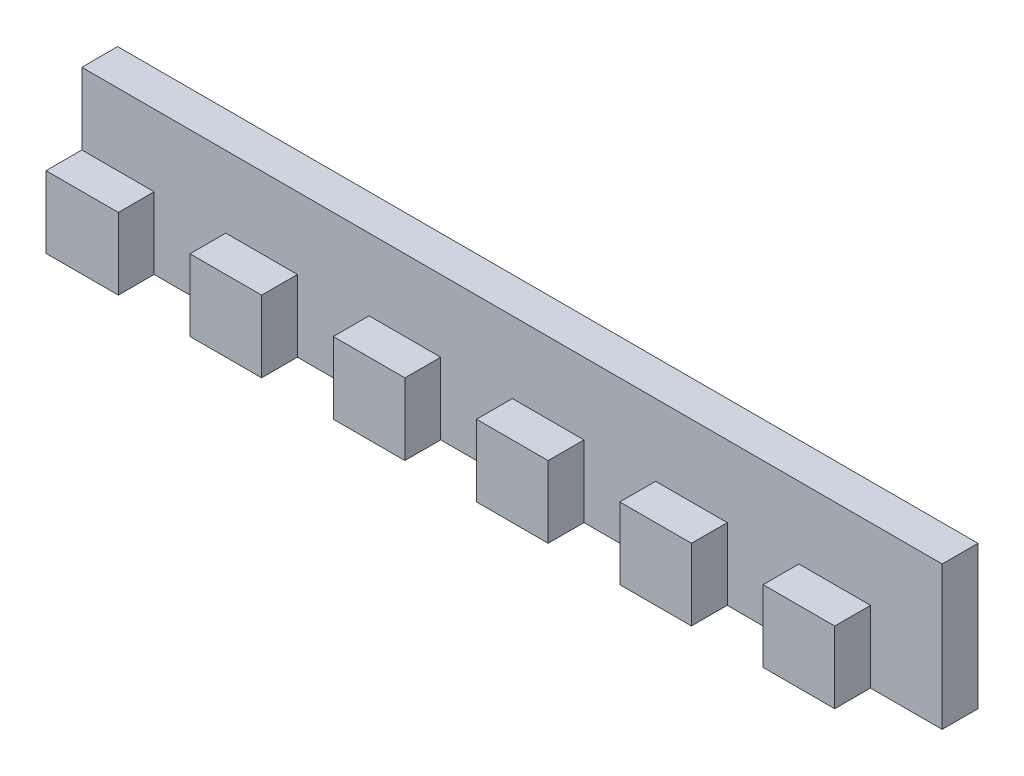
ISO-10303-21;
HEADER;
FILE_DESCRIPTION(('STEP AP214'),'2;1');
FILE_NAME('part.step','',(''),(''),'','','');
FILE_SCHEMA(('AUTOMOTIVE_DESIGN { 1 0 10303 214 1 1 1 1 }'));
ENDSEC;
DATA;
#1=APPLICATION_CONTEXT('core data for automotive mechanical design processes');
#2=APPLICATION_PROTOCOL_DEFINITION('international standard','automotive_design',2000,#1);
#3=PRODUCT_CONTEXT('',#1,'mechanical');
#4=PRODUCT('Part','Part','',(#3));
#5=PRODUCT_RELATED_PRODUCT_CATEGORY('part','',(#4));
#6=PRODUCT_DEFINITION_FORMATION('','',#4);
#7=PRODUCT_DEFINITION_CONTEXT('part definition',#1,'design');
#8=PRODUCT_DEFINITION('design','',#6,#7);
#9=PRODUCT_DEFINITION_SHAPE('','',#8);
#10=(LENGTH_UNIT() NAMED_UNIT(*) SI_UNIT(.MILLI.,.METRE.));
#11=(NAMED_UNIT(*) PLANE_ANGLE_UNIT() SI_UNIT($,.RADIAN.));
#12=(NAMED_UNIT(*) SI_UNIT($,.STERADIAN.) SOLID_ANGLE_UNIT());
#13=UNCERTAINTY_MEASURE_WITH_UNIT(LENGTH_MEASURE(1.E-05),#10,'distance_accuracy_value','');
#14=(GEOMETRIC_REPRESENTATION_CONTEXT(3) GLOBAL_UNCERTAINTY_ASSIGNED_CONTEXT((#13)) GLOBAL_UNIT_ASSIGNED_CONTEXT((#10,
#11,#12)) REPRESENTATION_CONTEXT('',''));
#15=CARTESIAN_POINT('',(0.,0.,0.));
#16=DIRECTION('',(0.,0.,1.));
#17=DIRECTION('',(1.,0.,0.));
#18=AXIS2_PLACEMENT_3D('',#15,#16,#17);
#19=CARTESIAN_POINT('',(0.,20.,-10.));
#20=DIRECTION('',(1.,0.,0.));
#21=DIRECTION('',(0.,0.,-1.));
#22=AXIS2_PLACEMENT_3D('',#19,#20,#21);
#23=PLANE('',#22);
#24=DIRECTION('',(0.,0.,1.));
#25=VECTOR('',#24,1.);
#26=CARTESIAN_POINT('',(0.,10.,-5.));
#27=LINE('',#26,#25);
#28=CARTESIAN_POINT('',(0.,10.,-5.));
#29=VERTEX_POINT('',#28);
#30=CARTESIAN_POINT('',(0.,10.,0.));
#31=VERTEX_POINT('',#30);
#32=EDGE_CURVE('E221',#29,#31,#27,.T.);
#33=ORIENTED_EDGE('',*,*,#32,.F.);
#34=DIRECTION('',(0.,-1.,0.));
#35=VECTOR('',#34,1.);
#36=CARTESIAN_POINT('',(0.,20.,-5.));
#37=LINE('',#36,#35);
#38=CARTESIAN_POINT('',(0.,20.,-5.));
#39=VERTEX_POINT('',#38);
#40=EDGE_CURVE('E231',#39,#29,#37,.T.);
#41=ORIENTED_EDGE('',*,*,#40,.F.);
#42=DIRECTION('',(0.,0.,1.));
#43=VECTOR('',#42,1.);
#44=CARTESIAN_POINT('',(0.,20.,-10.));
#45=LINE('',#44,#43);
#46=CARTESIAN_POINT('',(0.,20.,-10.));
#47=VERTEX_POINT('',#46);
#48=EDGE_CURVE('E277',#47,#39,#45,.T.);
#49=ORIENTED_EDGE('',*,*,#48,.F.);
#50=DIRECTION('',(0.,-1.,0.));
#51=VECTOR('',#50,1.);
#52=CARTESIAN_POINT('',(0.,20.,-10.));
#53=LINE('',#52,#51);
#54=CARTESIAN_POINT('',(0.,0.,-10.));
#55=VERTEX_POINT('',#54);
#56=EDGE_CURVE('E283',#47,#55,#53,.T.);
#57=ORIENTED_EDGE('',*,*,#56,.T.);
#58=DIRECTION('',(0.,0.,1.));
#59=VECTOR('',#58,1.);
#60=CARTESIAN_POINT('',(0.,0.,-10.));
#61=LINE('',#60,#59);
#62=CARTESIAN_POINT('',(0.,0.,0.));
#63=VERTEX_POINT('',#62);
#64=EDGE_CURVE('E276',#55,#63,#61,.T.);
#65=ORIENTED_EDGE('',*,*,#64,.T.);
#66=DIRECTION('',(0.,-1.,0.));
#67=VECTOR('',#66,1.);
#68=CARTESIAN_POINT('',(0.,20.,0.));
#69=LINE('',#68,#67);
#70=EDGE_CURVE('E11',#31,#63,#69,.T.);
#71=ORIENTED_EDGE('',*,*,#70,.F.);
#72=EDGE_LOOP('',(#33,#41,#49,#57,#65,#71));
#73=FACE_BOUND('',#72,.T.);
#74=ADVANCED_FACE('F33',(#73),#23,.F.);
#75=CARTESIAN_POINT('',(0.,20.,0.));
#76=DIRECTION('',(0.,0.,-1.));
#77=DIRECTION('',(-1.,0.,0.));
#78=AXIS2_PLACEMENT_3D('',#75,#76,#77);
#79=PLANE('',#78);
#80=DIRECTION('',(0.,-1.,0.));
#81=VECTOR('',#80,1.);
#82=CARTESIAN_POINT('',(10.0994070024501,20.,0.));
#83=LINE('',#82,#81);
#84=CARTESIAN_POINT('',(10.0994070024501,10.,0.));
#85=VERTEX_POINT('',#84);
#86=CARTESIAN_POINT('',(10.0994070024501,0.,0.));
#87=VERTEX_POINT('',#86);
#88=EDGE_CURVE('E41',#85,#87,#83,.T.);
#89=ORIENTED_EDGE('',*,*,#88,.F.);
#90=DIRECTION('',(-1.,0.,0.));
#91=VECTOR('',#90,1.);
#92=CARTESIAN_POINT('',(120.09940700245,10.,0.));
#93=LINE('',#92,#91);
#94=EDGE_CURVE('E241',#85,#31,#93,.T.);
#95=ORIENTED_EDGE('',*,*,#94,.T.);
#96=ORIENTED_EDGE('',*,*,#70,.T.);
#97=DIRECTION('',(1.,0.,0.));
#98=VECTOR('',#97,1.);
#99=CARTESIAN_POINT('',(0.,0.,0.));
#100=LINE('',#99,#98);
#101=EDGE_CURVE('E285',#63,#87,#100,.T.);
#102=ORIENTED_EDGE('',*,*,#101,.T.);
#103=EDGE_LOOP('',(#89,#95,#96,#102));
#104=FACE_BOUND('',#103,.T.);
#105=ADVANCED_FACE('F408',(#104),#79,.F.);
#106=CARTESIAN_POINT('',(10.0994070024501,20.,0.));
#107=DIRECTION('',(-1.,0.,0.));
#108=DIRECTION('',(0.,0.,1.));
#109=AXIS2_PLACEMENT_3D('',#106,#107,#108);
#110=PLANE('',#109);
#111=DIRECTION('',(0.,-1.,0.));
#112=VECTOR('',#111,1.);
#113=CARTESIAN_POINT('',(10.0994070024501,20.,-5.));
#114=LINE('',#113,#112);
#115=CARTESIAN_POINT('',(10.0994070024501,10.,-5.));
#116=VERTEX_POINT('',#115);
#117=CARTESIAN_POINT('',(10.0994070024501,0.,-5.));
#118=VERTEX_POINT('',#117);
#119=EDGE_CURVE('E400',#116,#118,#114,.T.);
#120=ORIENTED_EDGE('',*,*,#119,.F.);
#121=DIRECTION('',(0.,0.,1.));
#122=VECTOR('',#121,1.);
#123=CARTESIAN_POINT('',(10.0994070024501,10.,0.));
#124=LINE('',#123,#122);
#125=EDGE_CURVE('E224',#116,#85,#124,.T.);
#126=ORIENTED_EDGE('',*,*,#125,.T.);
#127=ORIENTED_EDGE('',*,*,#88,.T.);
#128=DIRECTION('',(0.,0.,-1.));
#129=VECTOR('',#128,1.);
#130=CARTESIAN_POINT('',(10.0994070024501,0.,0.));
#131=LINE('',#130,#129);
#132=EDGE_CURVE('E288',#87,#118,#131,.T.);
#133=ORIENTED_EDGE('',*,*,#132,.T.);
#134=EDGE_LOOP('',(#120,#126,#127,#133));
#135=FACE_BOUND('',#134,.T.);
#136=ADVANCED_FACE('F403',(#135),#110,.F.);
#137=CARTESIAN_POINT('',(20.0994070024501,20.,-5.));
#138=DIRECTION('',(1.,0.,0.));
#139=DIRECTION('',(0.,0.,-1.));
#140=AXIS2_PLACEMENT_3D('',#137,#138,#139);
#141=PLANE('',#140);
#142=DIRECTION('',(0.,-1.,0.));
#143=VECTOR('',#142,1.);
#144=CARTESIAN_POINT('',(20.0994070024501,20.,0.));
#145=LINE('',#144,#143);
#146=CARTESIAN_POINT('',(20.0994070024501,10.,0.));
#147=VERTEX_POINT('',#146);
#148=CARTESIAN_POINT('',(20.0994070024501,0.,0.));
#149=VERTEX_POINT('',#148);
#150=EDGE_CURVE('E396',#147,#149,#145,.T.);
#151=ORIENTED_EDGE('',*,*,#150,.F.);
#152=DIRECTION('',(0.,0.,-1.));
#153=VECTOR('',#152,1.);
#154=CARTESIAN_POINT('',(20.0994070024501,10.,-5.));
#155=LINE('',#154,#153);
#156=CARTESIAN_POINT('',(20.0994070024501,10.,-5.));
#157=VERTEX_POINT('',#156);
#158=EDGE_CURVE('E272',#147,#157,#155,.T.);
#159=ORIENTED_EDGE('',*,*,#158,.T.);
#160=DIRECTION('',(0.,-1.,0.));
#161=VECTOR('',#160,1.);
#162=CARTESIAN_POINT('',(20.0994070024501,20.,-5.));
#163=LINE('',#162,#161);
#164=CARTESIAN_POINT('',(20.0994070024501,0.,-5.));
#165=VERTEX_POINT('',#164);
#166=EDGE_CURVE('E398',#157,#165,#163,.T.);
#167=ORIENTED_EDGE('',*,*,#166,.T.);
#168=DIRECTION('',(0.,0.,1.));
#169=VECTOR('',#168,1.);
#170=CARTESIAN_POINT('',(20.0994070024501,0.,-5.));
#171=LINE('',#170,#169);
#172=EDGE_CURVE('E294',#165,#149,#171,.T.);
#173=ORIENTED_EDGE('',*,*,#172,.T.);
#174=EDGE_LOOP('',(#151,#159,#167,#173));
#175=FACE_BOUND('',#174,.T.);
#176=ADVANCED_FACE('F419',(#175),#141,.F.);
#177=CARTESIAN_POINT('',(20.0994070024501,20.,0.));
#178=DIRECTION('',(0.,0.,-1.));
#179=DIRECTION('',(-1.,0.,0.));
#180=AXIS2_PLACEMENT_3D('',#177,#178,#179);
#181=PLANE('',#180);
#182=DIRECTION('',(0.,-1.,0.));
#183=VECTOR('',#182,1.);
#184=CARTESIAN_POINT('',(30.0994070024501,20.,0.));
#185=LINE('',#184,#183);
#186=CARTESIAN_POINT('',(30.0994070024501,10.,0.));
#187=VERTEX_POINT('',#186);
#188=CARTESIAN_POINT('',(30.0994070024501,0.,0.));
#189=VERTEX_POINT('',#188);
#190=EDGE_CURVE('E394',#187,#189,#185,.T.);
#191=ORIENTED_EDGE('',*,*,#190,.F.);
#192=EDGE_CURVE('E242',#187,#147,#93,.T.);
#193=ORIENTED_EDGE('',*,*,#192,.T.);
#194=ORIENTED_EDGE('',*,*,#150,.T.);
#195=DIRECTION('',(1.,0.,0.));
#196=VECTOR('',#195,1.);
#197=CARTESIAN_POINT('',(20.0994070024501,0.,0.));
#198=LINE('',#197,#196);
#199=EDGE_CURVE('E297',#149,#189,#198,.T.);
#200=ORIENTED_EDGE('',*,*,#199,.T.);
#201=EDGE_LOOP('',(#191,#193,#194,#200));
#202=FACE_BOUND('',#201,.T.);
#203=ADVANCED_FACE('F425',(#202),#181,.F.);
#204=CARTESIAN_POINT('',(30.0994070024501,20.,0.));
#205=DIRECTION('',(-1.,0.,0.));
#206=DIRECTION('',(0.,0.,1.));
#207=AXIS2_PLACEMENT_3D('',#204,#205,#206);
#208=PLANE('',#207);
#209=DIRECTION('',(0.,-1.,0.));
#210=VECTOR('',#209,1.);
#211=CARTESIAN_POINT('',(30.0994070024501,20.,-5.));
#212=LINE('',#211,#210);
#213=CARTESIAN_POINT('',(30.0994070024501,10.,-5.));
#214=VERTEX_POINT('',#213);
#215=CARTESIAN_POINT('',(30.0994070024501,0.,-5.));
#216=VERTEX_POINT('',#215);
#217=EDGE_CURVE('E392',#214,#216,#212,.T.);
#218=ORIENTED_EDGE('',*,*,#217,.F.);
#219=DIRECTION('',(0.,0.,1.));
#220=VECTOR('',#219,1.);
#221=CARTESIAN_POINT('',(30.0994070024501,10.,0.));
#222=LINE('',#221,#220);
#223=EDGE_CURVE('E269',#214,#187,#222,.T.);
#224=ORIENTED_EDGE('',*,*,#223,.T.);
#225=ORIENTED_EDGE('',*,*,#190,.T.);
#226=DIRECTION('',(0.,0.,-1.));
#227=VECTOR('',#226,1.);
#228=CARTESIAN_POINT('',(30.0994070024501,0.,0.));
#229=LINE('',#228,#227);
#230=EDGE_CURVE('E300',#189,#216,#229,.T.);
#231=ORIENTED_EDGE('',*,*,#230,.T.);
#232=EDGE_LOOP('',(#218,#224,#225,#231));
#233=FACE_BOUND('',#232,.T.);
#234=ADVANCED_FACE('F527',(#233),#208,.F.);
#235=CARTESIAN_POINT('',(40.0994070024501,20.,-5.));
#236=DIRECTION('',(1.,0.,0.));
#237=DIRECTION('',(0.,0.,-1.));
#238=AXIS2_PLACEMENT_3D('',#235,#236,#237);
#239=PLANE('',#238);
#240=DIRECTION('',(0.,-1.,0.));
#241=VECTOR('',#240,1.);
#242=CARTESIAN_POINT('',(40.0994070024501,20.,0.));
#243=LINE('',#242,#241);
#244=CARTESIAN_POINT('',(40.0994070024501,10.,0.));
#245=VERTEX_POINT('',#244);
#246=CARTESIAN_POINT('',(40.0994070024501,0.,0.));
#247=VERTEX_POINT('',#246);
#248=EDGE_CURVE('E388',#245,#247,#243,.T.);
#249=ORIENTED_EDGE('',*,*,#248,.F.);
#250=DIRECTION('',(0.,0.,-1.));
#251=VECTOR('',#250,1.);
#252=CARTESIAN_POINT('',(40.0994070024501,10.,-5.));
#253=LINE('',#252,#251);
#254=CARTESIAN_POINT('',(40.0994070024501,10.,-5.));
#255=VERTEX_POINT('',#254);
#256=EDGE_CURVE('E266',#245,#255,#253,.T.);
#257=ORIENTED_EDGE('',*,*,#256,.T.);
#258=DIRECTION('',(0.,-1.,0.));
#259=VECTOR('',#258,1.);
#260=CARTESIAN_POINT('',(40.0994070024501,20.,-5.));
#261=LINE('',#260,#259);
#262=CARTESIAN_POINT('',(40.0994070024501,0.,-5.));
#263=VERTEX_POINT('',#262);
#264=EDGE_CURVE('E390',#255,#263,#261,.T.);
#265=ORIENTED_EDGE('',*,*,#264,.T.);
#266=DIRECTION('',(0.,0.,1.));
#267=VECTOR('',#266,1.);
#268=CARTESIAN_POINT('',(40.0994070024501,0.,-5.));
#269=LINE('',#268,#267);
#270=EDGE_CURVE('E306',#263,#247,#269,.T.);
#271=ORIENTED_EDGE('',*,*,#270,.T.);
#272=EDGE_LOOP('',(#249,#257,#265,#271));
#273=FACE_BOUND('',#272,.T.);
#274=ADVANCED_FACE('F473',(#273),#239,.F.);
#275=CARTESIAN_POINT('',(40.0994070024501,20.,0.));
#276=DIRECTION('',(0.,0.,-1.));
#277=DIRECTION('',(-1.,0.,0.));
#278=AXIS2_PLACEMENT_3D('',#275,#276,#277);
#279=PLANE('',#278);
#280=DIRECTION('',(0.,-1.,0.));
#281=VECTOR('',#280,1.);
#282=CARTESIAN_POINT('',(50.0994070024501,20.,0.));
#283=LINE('',#282,#281);
#284=CARTESIAN_POINT('',(50.0994070024501,10.,0.));
#285=VERTEX_POINT('',#284);
#286=CARTESIAN_POINT('',(50.0994070024501,0.,0.));
#287=VERTEX_POINT('',#286);
#288=EDGE_CURVE('E386',#285,#287,#283,.T.);
#289=ORIENTED_EDGE('',*,*,#288,.F.);
#290=EDGE_CURVE('E426',#285,#245,#93,.T.);
#291=ORIENTED_EDGE('',*,*,#290,.T.);
#292=ORIENTED_EDGE('',*,*,#248,.T.);
#293=DIRECTION('',(1.,0.,0.));
#294=VECTOR('',#293,1.);
#295=CARTESIAN_POINT('',(40.0994070024501,0.,0.));
#296=LINE('',#295,#294);
#297=EDGE_CURVE('E309',#247,#287,#296,.T.);
#298=ORIENTED_EDGE('',*,*,#297,.T.);
#299=EDGE_LOOP('',(#289,#291,#292,#298));
#300=FACE_BOUND('',#299,.T.);
#301=ADVANCED_FACE('F480',(#300),#279,.F.);
#302=CARTESIAN_POINT('',(50.0994070024501,20.,0.));
#303=DIRECTION('',(-1.,0.,0.));
#304=DIRECTION('',(0.,0.,1.));
#305=AXIS2_PLACEMENT_3D('',#302,#303,#304);
#306=PLANE('',#305);
#307=DIRECTION('',(0.,-1.,0.));
#308=VECTOR('',#307,1.);
#309=CARTESIAN_POINT('',(50.0994070024501,20.,-5.));
#310=LINE('',#309,#308);
#311=CARTESIAN_POINT('',(50.0994070024501,10.,-5.));
#312=VERTEX_POINT('',#311);
#313=CARTESIAN_POINT('',(50.0994070024501,0.,-5.));
#314=VERTEX_POINT('',#313);
#315=EDGE_CURVE('E384',#312,#314,#310,.T.);
#316=ORIENTED_EDGE('',*,*,#315,.F.);
#317=DIRECTION('',(0.,0.,1.));
#318=VECTOR('',#317,1.);
#319=CARTESIAN_POINT('',(50.0994070024501,10.,0.));
#320=LINE('',#319,#318);
#321=EDGE_CURVE('E263',#312,#285,#320,.T.);
#322=ORIENTED_EDGE('',*,*,#321,.T.);
#323=ORIENTED_EDGE('',*,*,#288,.T.);
#324=DIRECTION('',(0.,0.,-1.));
#325=VECTOR('',#324,1.);
#326=CARTESIAN_POINT('',(50.0994070024501,0.,0.));
#327=LINE('',#326,#325);
#328=EDGE_CURVE('E312',#287,#314,#327,.T.);
#329=ORIENTED_EDGE('',*,*,#328,.T.);
#330=EDGE_LOOP('',(#316,#322,#323,#329));
#331=FACE_BOUND('',#330,.T.);
#332=ADVANCED_FACE('F482',(#331),#306,.F.);
#333=CARTESIAN_POINT('',(60.0994070024501,20.,-5.));
#334=DIRECTION('',(1.,0.,0.));
#335=DIRECTION('',(0.,0.,-1.));
#336=AXIS2_PLACEMENT_3D('',#333,#334,#335);
#337=PLANE('',#336);
#338=DIRECTION('',(0.,-1.,0.));
#339=VECTOR('',#338,1.);
#340=CARTESIAN_POINT('',(60.0994070024501,20.,0.));
#341=LINE('',#340,#339);
#342=CARTESIAN_POINT('',(60.0994070024501,10.,0.));
#343=VERTEX_POINT('',#342);
#344=CARTESIAN_POINT('',(60.0994070024501,0.,0.));
#345=VERTEX_POINT('',#344);
#346=EDGE_CURVE('E380',#343,#345,#341,.T.);
#347=ORIENTED_EDGE('',*,*,#346,.F.);
#348=DIRECTION('',(0.,0.,-1.));
#349=VECTOR('',#348,1.);
#350=CARTESIAN_POINT('',(60.0994070024501,10.,-5.));
#351=LINE('',#350,#349);
#352=CARTESIAN_POINT('',(60.0994070024501,10.,-5.));
#353=VERTEX_POINT('',#352);
#354=EDGE_CURVE('E260',#343,#353,#351,.T.);
#355=ORIENTED_EDGE('',*,*,#354,.T.);
#356=DIRECTION('',(0.,-1.,0.));
#357=VECTOR('',#356,1.);
#358=CARTESIAN_POINT('',(60.0994070024501,20.,-5.));
#359=LINE('',#358,#357);
#360=CARTESIAN_POINT('',(60.0994070024501,0.,-5.));
#361=VERTEX_POINT('',#360);
#362=EDGE_CURVE('E382',#353,#361,#359,.T.);
#363=ORIENTED_EDGE('',*,*,#362,.T.);
#364=DIRECTION('',(0.,0.,1.));
#365=VECTOR('',#364,1.);
#366=CARTESIAN_POINT('',(60.0994070024501,0.,-5.));
#367=LINE('',#366,#365);
#368=EDGE_CURVE('E318',#361,#345,#367,.T.);
#369=ORIENTED_EDGE('',*,*,#368,.T.);
#370=EDGE_LOOP('',(#347,#355,#363,#369));
#371=FACE_BOUND('',#370,.T.);
#372=ADVANCED_FACE('F488',(#371),#337,.F.);
#373=CARTESIAN_POINT('',(60.0994070024501,20.,0.));
#374=DIRECTION('',(0.,0.,-1.));
#375=DIRECTION('',(-1.,0.,0.));
#376=AXIS2_PLACEMENT_3D('',#373,#374,#375);
#377=PLANE('',#376);
#378=DIRECTION('',(0.,-1.,0.));
#379=VECTOR('',#378,1.);
#380=CARTESIAN_POINT('',(70.0994070024501,20.,0.));
#381=LINE('',#380,#379);
#382=CARTESIAN_POINT('',(70.0994070024501,10.,0.));
#383=VERTEX_POINT('',#382);
#384=CARTESIAN_POINT('',(70.0994070024501,0.,0.));
#385=VERTEX_POINT('',#384);
#386=EDGE_CURVE('E378',#383,#385,#381,.T.);
#387=ORIENTED_EDGE('',*,*,#386,.F.);
#388=EDGE_CURVE('E428',#383,#343,#93,.T.);
#389=ORIENTED_EDGE('',*,*,#388,.T.);
#390=ORIENTED_EDGE('',*,*,#346,.T.);
#391=DIRECTION('',(1.,0.,0.));
#392=VECTOR('',#391,1.);
#393=CARTESIAN_POINT('',(60.0994070024501,0.,0.));
#394=LINE('',#393,#392);
#395=EDGE_CURVE('E321',#345,#385,#394,.T.);
#396=ORIENTED_EDGE('',*,*,#395,.T.);
#397=EDGE_LOOP('',(#387,#389,#390,#396));
#398=FACE_BOUND('',#397,.T.);
#399=ADVANCED_FACE('F493',(#398),#377,.F.);
#400=CARTESIAN_POINT('',(70.0994070024501,20.,0.));
#401=DIRECTION('',(-1.,0.,0.));
#402=DIRECTION('',(0.,0.,1.));
#403=AXIS2_PLACEMENT_3D('',#400,#401,#402);
#404=PLANE('',#403);
#405=DIRECTION('',(0.,-1.,0.));
#406=VECTOR('',#405,1.);
#407=CARTESIAN_POINT('',(70.0994070024501,20.,-5.));
#408=LINE('',#407,#406);
#409=CARTESIAN_POINT('',(70.0994070024501,10.,-5.));
#410=VERTEX_POINT('',#409);
#411=CARTESIAN_POINT('',(70.0994070024501,0.,-5.));
#412=VERTEX_POINT('',#411);
#413=EDGE_CURVE('E376',#410,#412,#408,.T.);
#414=ORIENTED_EDGE('',*,*,#413,.F.);
#415=DIRECTION('',(0.,0.,1.));
#416=VECTOR('',#415,1.);
#417=CARTESIAN_POINT('',(70.0994070024501,10.,0.));
#418=LINE('',#417,#416);
#419=EDGE_CURVE('E257',#410,#383,#418,.T.);
#420=ORIENTED_EDGE('',*,*,#419,.T.);
#421=ORIENTED_EDGE('',*,*,#386,.T.);
#422=DIRECTION('',(0.,0.,-1.));
#423=VECTOR('',#422,1.);
#424=CARTESIAN_POINT('',(70.0994070024501,0.,0.));
#425=LINE('',#424,#423);
#426=EDGE_CURVE('E324',#385,#412,#425,.T.);
#427=ORIENTED_EDGE('',*,*,#426,.T.);
#428=EDGE_LOOP('',(#414,#420,#421,#427));
#429=FACE_BOUND('',#428,.T.);
#430=ADVANCED_FACE('F492',(#429),#404,.F.);
#431=CARTESIAN_POINT('',(80.0994070024501,20.,-5.));
#432=DIRECTION('',(1.,0.,0.));
#433=DIRECTION('',(0.,0.,-1.));
#434=AXIS2_PLACEMENT_3D('',#431,#432,#433);
#435=PLANE('',#434);
#436=DIRECTION('',(0.,-1.,0.));
#437=VECTOR('',#436,1.);
#438=CARTESIAN_POINT('',(80.0994070024501,20.,0.));
#439=LINE('',#438,#437);
#440=CARTESIAN_POINT('',(80.0994070024501,10.,0.));
#441=VERTEX_POINT('',#440);
#442=CARTESIAN_POINT('',(80.0994070024501,0.,0.));
#443=VERTEX_POINT('',#442);
#444=EDGE_CURVE('E372',#441,#443,#439,.T.);
#445=ORIENTED_EDGE('',*,*,#444,.F.);
#446=DIRECTION('',(0.,0.,-1.));
#447=VECTOR('',#446,1.);
#448=CARTESIAN_POINT('',(80.0994070024501,10.,-5.));
#449=LINE('',#448,#447);
#450=CARTESIAN_POINT('',(80.0994070024501,10.,-5.));
#451=VERTEX_POINT('',#450);
#452=EDGE_CURVE('E254',#441,#451,#449,.T.);
#453=ORIENTED_EDGE('',*,*,#452,.T.);
#454=DIRECTION('',(0.,-1.,0.));
#455=VECTOR('',#454,1.);
#456=CARTESIAN_POINT('',(80.0994070024501,20.,-5.));
#457=LINE('',#456,#455);
#458=CARTESIAN_POINT('',(80.0994070024501,0.,-5.));
#459=VERTEX_POINT('',#458);
#460=EDGE_CURVE('E374',#451,#459,#457,.T.);
#461=ORIENTED_EDGE('',*,*,#460,.T.);
#462=DIRECTION('',(0.,0.,1.));
#463=VECTOR('',#462,1.);
#464=CARTESIAN_POINT('',(80.0994070024501,0.,-5.));
#465=LINE('',#464,#463);
#466=EDGE_CURVE('E330',#459,#443,#465,.T.);
#467=ORIENTED_EDGE('',*,*,#466,.T.);
#468=EDGE_LOOP('',(#445,#453,#461,#467));
#469=FACE_BOUND('',#468,.T.);
#470=ADVANCED_FACE('F500',(#469),#435,.F.);
#471=CARTESIAN_POINT('',(80.0994070024501,20.,0.));
#472=DIRECTION('',(0.,0.,-1.));
#473=DIRECTION('',(-1.,0.,0.));
#474=AXIS2_PLACEMENT_3D('',#471,#472,#473);
#475=PLANE('',#474);
#476=DIRECTION('',(0.,-1.,0.));
#477=VECTOR('',#476,1.);
#478=CARTESIAN_POINT('',(90.0994070024501,20.,0.));
#479=LINE('',#478,#477);
#480=CARTESIAN_POINT('',(90.0994070024501,10.,0.));
#481=VERTEX_POINT('',#480);
#482=CARTESIAN_POINT('',(90.0994070024501,0.,0.));
#483=VERTEX_POINT('',#482);
#484=EDGE_CURVE('E370',#481,#483,#479,.T.);
#485=ORIENTED_EDGE('',*,*,#484,.F.);
#486=EDGE_CURVE('E433',#481,#441,#93,.T.);
#487=ORIENTED_EDGE('',*,*,#486,.T.);
#488=ORIENTED_EDGE('',*,*,#444,.T.);
#489=DIRECTION('',(1.,0.,0.));
#490=VECTOR('',#489,1.);
#491=CARTESIAN_POINT('',(80.0994070024501,0.,0.));
#492=LINE('',#491,#490);
#493=EDGE_CURVE('E333',#443,#483,#492,.T.);
#494=ORIENTED_EDGE('',*,*,#493,.T.);
#495=EDGE_LOOP('',(#485,#487,#488,#494));
#496=FACE_BOUND('',#495,.T.);
#497=ADVANCED_FACE('F504',(#496),#475,.F.);
#498=CARTESIAN_POINT('',(90.0994070024501,20.,0.));
#499=DIRECTION('',(-1.,0.,0.));
#500=DIRECTION('',(0.,0.,1.));
#501=AXIS2_PLACEMENT_3D('',#498,#499,#500);
#502=PLANE('',#501);
#503=DIRECTION('',(0.,-1.,0.));
#504=VECTOR('',#503,1.);
#505=CARTESIAN_POINT('',(90.0994070024501,20.,-5.));
#506=LINE('',#505,#504);
#507=CARTESIAN_POINT('',(90.0994070024501,10.,-5.));
#508=VERTEX_POINT('',#507);
#509=CARTESIAN_POINT('',(90.0994070024501,0.,-5.));
#510=VERTEX_POINT('',#509);
#511=EDGE_CURVE('E368',#508,#510,#506,.T.);
#512=ORIENTED_EDGE('',*,*,#511,.F.);
#513=DIRECTION('',(0.,0.,1.));
#514=VECTOR('',#513,1.);
#515=CARTESIAN_POINT('',(90.0994070024501,10.,0.));
#516=LINE('',#515,#514);
#517=EDGE_CURVE('E251',#508,#481,#516,.T.);
#518=ORIENTED_EDGE('',*,*,#517,.T.);
#519=ORIENTED_EDGE('',*,*,#484,.T.);
#520=DIRECTION('',(0.,0.,-1.));
#521=VECTOR('',#520,1.);
#522=CARTESIAN_POINT('',(90.0994070024501,0.,0.));
#523=LINE('',#522,#521);
#524=EDGE_CURVE('E336',#483,#510,#523,.T.);
#525=ORIENTED_EDGE('',*,*,#524,.T.);
#526=EDGE_LOOP('',(#512,#518,#519,#525));
#527=FACE_BOUND('',#526,.T.);
#528=ADVANCED_FACE('F503',(#527),#502,.F.);
#529=CARTESIAN_POINT('',(100.09940700245,20.,-5.));
#530=DIRECTION('',(1.,0.,0.));
#531=DIRECTION('',(0.,0.,-1.));
#532=AXIS2_PLACEMENT_3D('',#529,#530,#531);
#533=PLANE('',#532);
#534=DIRECTION('',(0.,-1.,0.));
#535=VECTOR('',#534,1.);
#536=CARTESIAN_POINT('',(100.09940700245,20.,0.));
#537=LINE('',#536,#535);
#538=CARTESIAN_POINT('',(100.09940700245,10.,0.));
#539=VERTEX_POINT('',#538);
#540=CARTESIAN_POINT('',(100.09940700245,0.,0.));
#541=VERTEX_POINT('',#540);
#542=EDGE_CURVE('E364',#539,#541,#537,.T.);
#543=ORIENTED_EDGE('',*,*,#542,.F.);
#544=DIRECTION('',(0.,0.,-1.));
#545=VECTOR('',#544,1.);
#546=CARTESIAN_POINT('',(100.09940700245,10.,-5.));
#547=LINE('',#546,#545);
#548=CARTESIAN_POINT('',(100.09940700245,10.,-5.));
#549=VERTEX_POINT('',#548);
#550=EDGE_CURVE('E248',#539,#549,#547,.T.);
#551=ORIENTED_EDGE('',*,*,#550,.T.);
#552=DIRECTION('',(0.,-1.,0.));
#553=VECTOR('',#552,1.);
#554=CARTESIAN_POINT('',(100.09940700245,20.,-5.));
#555=LINE('',#554,#553);
#556=CARTESIAN_POINT('',(100.09940700245,0.,-5.));
#557=VERTEX_POINT('',#556);
#558=EDGE_CURVE('E366',#549,#557,#555,.T.);
#559=ORIENTED_EDGE('',*,*,#558,.T.);
#560=DIRECTION('',(0.,0.,1.));
#561=VECTOR('',#560,1.);
#562=CARTESIAN_POINT('',(100.09940700245,0.,-5.));
#563=LINE('',#562,#561);
#564=EDGE_CURVE('E342',#557,#541,#563,.T.);
#565=ORIENTED_EDGE('',*,*,#564,.T.);
#566=EDGE_LOOP('',(#543,#551,#559,#565));
#567=FACE_BOUND('',#566,.T.);
#568=ADVANCED_FACE('F448',(#567),#533,.F.);
#569=CARTESIAN_POINT('',(100.09940700245,20.,0.));
#570=DIRECTION('',(0.,0.,-1.));
#571=DIRECTION('',(-1.,0.,0.));
#572=AXIS2_PLACEMENT_3D('',#569,#570,#571);
#573=PLANE('',#572);
#574=DIRECTION('',(0.,-1.,0.));
#575=VECTOR('',#574,1.);
#576=CARTESIAN_POINT('',(110.09940700245,20.,0.));
#577=LINE('',#576,#575);
#578=CARTESIAN_POINT('',(110.09940700245,10.,0.));
#579=VERTEX_POINT('',#578);
#580=CARTESIAN_POINT('',(110.09940700245,0.,0.));
#581=VERTEX_POINT('',#580);
#582=EDGE_CURVE('E362',#579,#581,#577,.T.);
#583=ORIENTED_EDGE('',*,*,#582,.F.);
#584=EDGE_CURVE('E243',#579,#539,#93,.T.);
#585=ORIENTED_EDGE('',*,*,#584,.T.);
#586=ORIENTED_EDGE('',*,*,#542,.T.);
#587=DIRECTION('',(1.,0.,0.));
#588=VECTOR('',#587,1.);
#589=CARTESIAN_POINT('',(100.09940700245,0.,0.));
#590=LINE('',#589,#588);
#591=EDGE_CURVE('E345',#541,#581,#590,.T.);
#592=ORIENTED_EDGE('',*,*,#591,.T.);
#593=EDGE_LOOP('',(#583,#585,#586,#592));
#594=FACE_BOUND('',#593,.T.);
#595=ADVANCED_FACE('F445',(#594),#573,.F.);
#596=CARTESIAN_POINT('',(110.09940700245,20.,0.));
#597=DIRECTION('',(-1.,0.,0.));
#598=DIRECTION('',(0.,0.,1.));
#599=AXIS2_PLACEMENT_3D('',#596,#597,#598);
#600=PLANE('',#599);
#601=DIRECTION('',(0.,-1.,0.));
#602=VECTOR('',#601,1.);
#603=CARTESIAN_POINT('',(110.09940700245,20.,-5.));
#604=LINE('',#603,#602);
#605=CARTESIAN_POINT('',(110.09940700245,10.,-5.));
#606=VERTEX_POINT('',#605);
#607=CARTESIAN_POINT('',(110.09940700245,0.,-5.));
#608=VERTEX_POINT('',#607);
#609=EDGE_CURVE('E360',#606,#608,#604,.T.);
#610=ORIENTED_EDGE('',*,*,#609,.F.);
#611=DIRECTION('',(0.,0.,1.));
#612=VECTOR('',#611,1.);
#613=CARTESIAN_POINT('',(110.09940700245,10.,0.));
#614=LINE('',#613,#612);
#615=EDGE_CURVE('E245',#606,#579,#614,.T.);
#616=ORIENTED_EDGE('',*,*,#615,.T.);
#617=ORIENTED_EDGE('',*,*,#582,.T.);
#618=DIRECTION('',(0.,0.,-1.));
#619=VECTOR('',#618,1.);
#620=CARTESIAN_POINT('',(110.09940700245,0.,0.));
#621=LINE('',#620,#619);
#622=EDGE_CURVE('E348',#581,#608,#621,.T.);
#623=ORIENTED_EDGE('',*,*,#622,.T.);
#624=EDGE_LOOP('',(#610,#616,#617,#623));
#625=FACE_BOUND('',#624,.T.);
#626=ADVANCED_FACE('F457',(#625),#600,.F.);
#627=CARTESIAN_POINT('',(110.09940700245,20.,-5.));
#628=DIRECTION('',(0.,0.,-1.));
#629=DIRECTION('',(-1.,0.,0.));
#630=AXIS2_PLACEMENT_3D('',#627,#628,#629);
#631=PLANE('',#630);
#632=DIRECTION('',(1.,0.,0.));
#633=VECTOR('',#632,1.);
#634=CARTESIAN_POINT('',(110.09940700245,0.,-5.));
#635=LINE('',#634,#633);
#636=CARTESIAN_POINT('',(120.09940700245,0.,-5.));
#637=VERTEX_POINT('',#636);
#638=EDGE_CURVE('E351',#608,#637,#635,.T.);
#639=ORIENTED_EDGE('',*,*,#638,.T.);
#640=DIRECTION('',(0.,-1.,0.));
#641=VECTOR('',#640,1.);
#642=CARTESIAN_POINT('',(120.09940700245,20.,-5.));
#643=LINE('',#642,#641);
#644=CARTESIAN_POINT('',(120.09940700245,20.,-5.));
#645=VERTEX_POINT('',#644);
#646=EDGE_CURVE('E358',#645,#637,#643,.T.);
#647=ORIENTED_EDGE('',*,*,#646,.F.);
#648=DIRECTION('',(1.,0.,0.));
#649=VECTOR('',#648,1.);
#650=CARTESIAN_POINT('',(10.0994070024501,20.,-5.));
#651=LINE('',#650,#649);
#652=EDGE_CURVE('E140',#39,#645,#651,.T.);
#653=ORIENTED_EDGE('',*,*,#652,.F.);
#654=ORIENTED_EDGE('',*,*,#40,.T.);
#655=DIRECTION('',(-1.,0.,0.));
#656=VECTOR('',#655,1.);
#657=CARTESIAN_POINT('',(120.09940700245,10.,-5.));
#658=LINE('',#657,#656);
#659=EDGE_CURVE('E217',#116,#29,#658,.T.);
#660=ORIENTED_EDGE('',*,*,#659,.F.);
#661=ORIENTED_EDGE('',*,*,#119,.T.);
#662=DIRECTION('',(1.,0.,0.));
#663=VECTOR('',#662,1.);
#664=CARTESIAN_POINT('',(10.0994070024501,0.,-5.));
#665=LINE('',#664,#663);
#666=EDGE_CURVE('E291',#118,#165,#665,.T.);
#667=ORIENTED_EDGE('',*,*,#666,.T.);
#668=ORIENTED_EDGE('',*,*,#166,.F.);
#669=EDGE_CURVE('E227',#214,#157,#658,.T.);
#670=ORIENTED_EDGE('',*,*,#669,.F.);
#671=ORIENTED_EDGE('',*,*,#217,.T.);
#672=DIRECTION('',(1.,0.,0.));
#673=VECTOR('',#672,1.);
#674=CARTESIAN_POINT('',(30.0994070024501,0.,-5.));
#675=LINE('',#674,#673);
#676=EDGE_CURVE('E303',#216,#263,#675,.T.);
#677=ORIENTED_EDGE('',*,*,#676,.T.);
#678=ORIENTED_EDGE('',*,*,#264,.F.);
#679=EDGE_CURVE('E464',#312,#255,#658,.T.);
#680=ORIENTED_EDGE('',*,*,#679,.F.);
#681=ORIENTED_EDGE('',*,*,#315,.T.);
#682=DIRECTION('',(1.,0.,0.));
#683=VECTOR('',#682,1.);
#684=CARTESIAN_POINT('',(50.0994070024501,0.,-5.));
#685=LINE('',#684,#683);
#686=EDGE_CURVE('E315',#314,#361,#685,.T.);
#687=ORIENTED_EDGE('',*,*,#686,.T.);
#688=ORIENTED_EDGE('',*,*,#362,.F.);
#689=EDGE_CURVE('E461',#410,#353,#658,.T.);
#690=ORIENTED_EDGE('',*,*,#689,.F.);
#691=ORIENTED_EDGE('',*,*,#413,.T.);
#692=DIRECTION('',(1.,0.,0.));
#693=VECTOR('',#692,1.);
#694=CARTESIAN_POINT('',(70.0994070024501,0.,-5.));
#695=LINE('',#694,#693);
#696=EDGE_CURVE('E327',#412,#459,#695,.T.);
#697=ORIENTED_EDGE('',*,*,#696,.T.);
#698=ORIENTED_EDGE('',*,*,#460,.F.);
#699=EDGE_CURVE('E460',#508,#451,#658,.T.);
#700=ORIENTED_EDGE('',*,*,#699,.F.);
#701=ORIENTED_EDGE('',*,*,#511,.T.);
#702=DIRECTION('',(1.,0.,0.));
#703=VECTOR('',#702,1.);
#704=CARTESIAN_POINT('',(90.0994070024501,0.,-5.));
#705=LINE('',#704,#703);
#706=EDGE_CURVE('E339',#510,#557,#705,.T.);
#707=ORIENTED_EDGE('',*,*,#706,.T.);
#708=ORIENTED_EDGE('',*,*,#558,.F.);
#709=EDGE_CURVE('E229',#606,#549,#658,.T.);
#710=ORIENTED_EDGE('',*,*,#709,.F.);
#711=ORIENTED_EDGE('',*,*,#609,.T.);
#712=EDGE_LOOP('',(#639,#647,#653,#654,#660,#661,#667,#668,#670,#671,#677,#678,#680,#681,#687,
#688,#690,#691,#697,#698,#700,#701,#707,#708,#710,#711));
#713=FACE_BOUND('',#712,.T.);
#714=ADVANCED_FACE('F233',(#713),#631,.F.);
#715=CARTESIAN_POINT('',(120.09940700245,20.,-5.));
#716=DIRECTION('',(-1.,0.,0.));
#717=DIRECTION('',(0.,0.,1.));
#718=AXIS2_PLACEMENT_3D('',#715,#716,#717);
#719=PLANE('',#718);
#720=DIRECTION('',(0.,0.,-1.));
#721=VECTOR('',#720,1.);
#722=CARTESIAN_POINT('',(120.09940700245,0.,-5.));
#723=LINE('',#722,#721);
#724=CARTESIAN_POINT('',(120.09940700245,0.,-10.));
#725=VERTEX_POINT('',#724);
#726=EDGE_CURVE('E131',#637,#725,#723,.T.);
#727=ORIENTED_EDGE('',*,*,#726,.T.);
#728=DIRECTION('',(0.,-1.,0.));
#729=VECTOR('',#728,1.);
#730=CARTESIAN_POINT('',(120.09940700245,20.,-10.));
#731=LINE('',#730,#729);
#732=CARTESIAN_POINT('',(120.09940700245,20.,-10.));
#733=VERTEX_POINT('',#732);
#734=EDGE_CURVE('E356',#733,#725,#731,.T.);
#735=ORIENTED_EDGE('',*,*,#734,.F.);
#736=DIRECTION('',(0.,0.,-1.));
#737=VECTOR('',#736,1.);
#738=CARTESIAN_POINT('',(120.09940700245,20.,-5.));
#739=LINE('',#738,#737);
#740=EDGE_CURVE('E280',#645,#733,#739,.T.);
#741=ORIENTED_EDGE('',*,*,#740,.F.);
#742=ORIENTED_EDGE('',*,*,#646,.T.);
#743=EDGE_LOOP('',(#727,#735,#741,#742));
#744=FACE_BOUND('',#743,.T.);
#745=ADVANCED_FACE('F594',(#744),#719,.F.);
#746=CARTESIAN_POINT('',(120.09940700245,20.,-10.));
#747=DIRECTION('',(0.,0.,1.));
#748=DIRECTION('',(1.,0.,0.));
#749=AXIS2_PLACEMENT_3D('',#746,#747,#748);
#750=PLANE('',#749);
#751=DIRECTION('',(-1.,0.,0.));
#752=VECTOR('',#751,1.);
#753=CARTESIAN_POINT('',(120.09940700245,0.,-10.));
#754=LINE('',#753,#752);
#755=EDGE_CURVE('E136',#725,#55,#754,.T.);
#756=ORIENTED_EDGE('',*,*,#755,.T.);
#757=ORIENTED_EDGE('',*,*,#56,.F.);
#758=DIRECTION('',(-1.,0.,0.));
#759=VECTOR('',#758,1.);
#760=CARTESIAN_POINT('',(120.09940700245,20.,-10.));
#761=LINE('',#760,#759);
#762=EDGE_CURVE('E49',#733,#47,#761,.T.);
#763=ORIENTED_EDGE('',*,*,#762,.F.);
#764=ORIENTED_EDGE('',*,*,#734,.T.);
#765=EDGE_LOOP('',(#756,#757,#763,#764));
#766=FACE_BOUND('',#765,.T.);
#767=ADVANCED_FACE('F605',(#766),#750,.F.);
#768=CARTESIAN_POINT('',(0.,20.,0.));
#769=DIRECTION('',(0.,1.,0.));
#770=DIRECTION('',(0.,0.,1.));
#771=AXIS2_PLACEMENT_3D('',#768,#769,#770);
#772=PLANE('',#771);
#773=ORIENTED_EDGE('',*,*,#652,.T.);
#774=ORIENTED_EDGE('',*,*,#740,.T.);
#775=ORIENTED_EDGE('',*,*,#762,.T.);
#776=ORIENTED_EDGE('',*,*,#48,.T.);
#777=EDGE_LOOP('',(#773,#774,#775,#776));
#778=FACE_BOUND('',#777,.T.);
#779=ADVANCED_FACE('F612',(#778),#772,.T.);
#780=CARTESIAN_POINT('',(0.,0.,0.));
#781=DIRECTION('',(0.,1.,0.));
#782=DIRECTION('',(0.,0.,1.));
#783=AXIS2_PLACEMENT_3D('',#780,#781,#782);
#784=PLANE('',#783);
#785=ORIENTED_EDGE('',*,*,#64,.F.);
#786=ORIENTED_EDGE('',*,*,#755,.F.);
#787=ORIENTED_EDGE('',*,*,#726,.F.);
#788=ORIENTED_EDGE('',*,*,#638,.F.);
#789=ORIENTED_EDGE('',*,*,#622,.F.);
#790=ORIENTED_EDGE('',*,*,#591,.F.);
#791=ORIENTED_EDGE('',*,*,#564,.F.);
#792=ORIENTED_EDGE('',*,*,#706,.F.);
#793=ORIENTED_EDGE('',*,*,#524,.F.);
#794=ORIENTED_EDGE('',*,*,#493,.F.);
#795=ORIENTED_EDGE('',*,*,#466,.F.);
#796=ORIENTED_EDGE('',*,*,#696,.F.);
#797=ORIENTED_EDGE('',*,*,#426,.F.);
#798=ORIENTED_EDGE('',*,*,#395,.F.);
#799=ORIENTED_EDGE('',*,*,#368,.F.);
#800=ORIENTED_EDGE('',*,*,#686,.F.);
#801=ORIENTED_EDGE('',*,*,#328,.F.);
#802=ORIENTED_EDGE('',*,*,#297,.F.);
#803=ORIENTED_EDGE('',*,*,#270,.F.);
#804=ORIENTED_EDGE('',*,*,#676,.F.);
#805=ORIENTED_EDGE('',*,*,#230,.F.);
#806=ORIENTED_EDGE('',*,*,#199,.F.);
#807=ORIENTED_EDGE('',*,*,#172,.F.);
#808=ORIENTED_EDGE('',*,*,#666,.F.);
#809=ORIENTED_EDGE('',*,*,#132,.F.);
#810=ORIENTED_EDGE('',*,*,#101,.F.);
#811=EDGE_LOOP('',(#785,#786,#787,#788,#789,#790,#791,#792,#793,#794,#795,#796,#797,#798,#799,
#800,#801,#802,#803,#804,#805,#806,#807,#808,#809,#810));
#812=FACE_BOUND('',#811,.T.);
#813=ADVANCED_FACE('F411',(#812),#784,.F.);
#814=CARTESIAN_POINT('',(120.09940700245,10.,-5.));
#815=DIRECTION('',(0.,-1.,0.));
#816=DIRECTION('',(0.,0.,-1.));
#817=AXIS2_PLACEMENT_3D('',#814,#815,#816);
#818=PLANE('',#817);
#819=ORIENTED_EDGE('',*,*,#659,.T.);
#820=ORIENTED_EDGE('',*,*,#32,.T.);
#821=ORIENTED_EDGE('',*,*,#94,.F.);
#822=ORIENTED_EDGE('',*,*,#125,.F.);
#823=EDGE_LOOP('',(#819,#820,#821,#822));
#824=FACE_BOUND('',#823,.T.);
#825=ADVANCED_FACE('F219',(#824),#818,.F.);
#826=ORIENTED_EDGE('',*,*,#192,.F.);
#827=ORIENTED_EDGE('',*,*,#223,.F.);
#828=ORIENTED_EDGE('',*,*,#669,.T.);
#829=ORIENTED_EDGE('',*,*,#158,.F.);
#830=EDGE_LOOP('',(#826,#827,#828,#829));
#831=FACE_BOUND('',#830,.T.);
#832=ADVANCED_FACE('F422',(#831),#818,.F.);
#833=ORIENTED_EDGE('',*,*,#290,.F.);
#834=ORIENTED_EDGE('',*,*,#321,.F.);
#835=ORIENTED_EDGE('',*,*,#679,.T.);
#836=ORIENTED_EDGE('',*,*,#256,.F.);
#837=EDGE_LOOP('',(#833,#834,#835,#836));
#838=FACE_BOUND('',#837,.T.);
#839=ADVANCED_FACE('F469',(#838),#818,.F.);
#840=ORIENTED_EDGE('',*,*,#388,.F.);
#841=ORIENTED_EDGE('',*,*,#419,.F.);
#842=ORIENTED_EDGE('',*,*,#689,.T.);
#843=ORIENTED_EDGE('',*,*,#354,.F.);
#844=EDGE_LOOP('',(#840,#841,#842,#843));
#845=FACE_BOUND('',#844,.T.);
#846=ADVANCED_FACE('F489',(#845),#818,.F.);
#847=ORIENTED_EDGE('',*,*,#486,.F.);
#848=ORIENTED_EDGE('',*,*,#517,.F.);
#849=ORIENTED_EDGE('',*,*,#699,.T.);
#850=ORIENTED_EDGE('',*,*,#452,.F.);
#851=EDGE_LOOP('',(#847,#848,#849,#850));
#852=FACE_BOUND('',#851,.T.);
#853=ADVANCED_FACE('F501',(#852),#818,.F.);
#854=ORIENTED_EDGE('',*,*,#584,.F.);
#855=ORIENTED_EDGE('',*,*,#615,.F.);
#856=ORIENTED_EDGE('',*,*,#709,.T.);
#857=ORIENTED_EDGE('',*,*,#550,.F.);
#858=EDGE_LOOP('',(#854,#855,#856,#857));
#859=FACE_BOUND('',#858,.T.);
#860=ADVANCED_FACE('F459',(#859),#818,.F.);
#861=CLOSED_SHELL('',(#74,#105,#136,#176,#203,#234,#274,#301,#332,#372,#399,#430,#470,#497,#528,
#568,#595,#626,#714,#745,#767,#779,#813,#825,#832,#839,#846,#853,#860));
#862=MANIFOLD_SOLID_BREP('B2',#861);
#863=ADVANCED_BREP_SHAPE_REPRESENTATION('',(#18,#862),#14);
#864=SHAPE_DEFINITION_REPRESENTATION(#9,#863);
ENDSEC;
END-ISO-10303-21;
